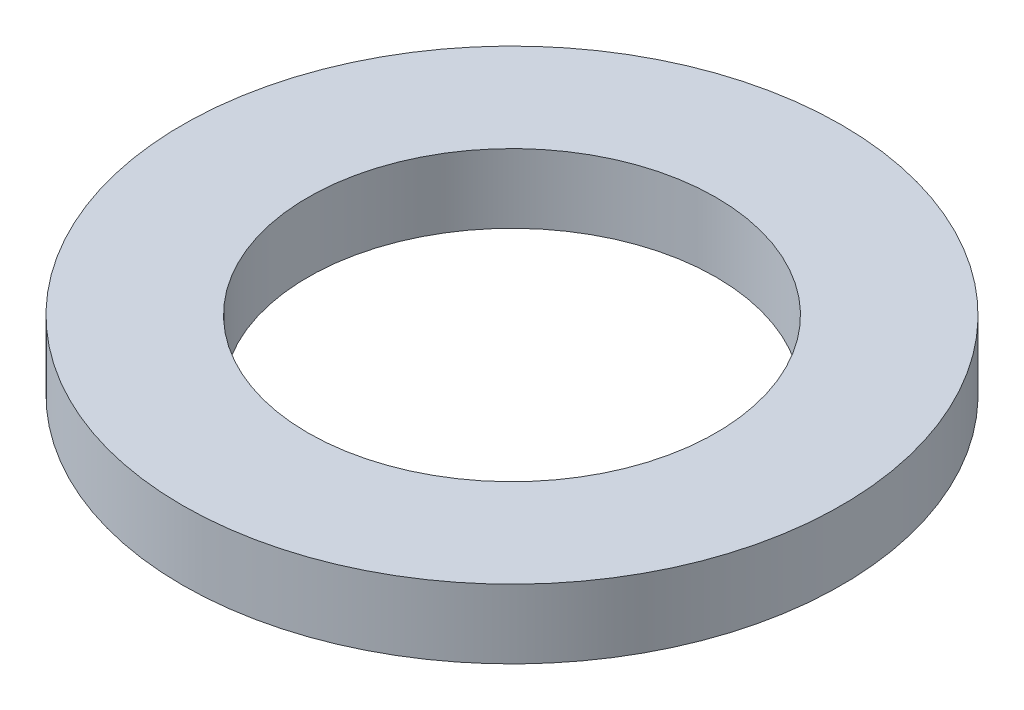
ISO-10303-21;
HEADER;
FILE_DESCRIPTION(('STEP AP214'),'2;1');
FILE_NAME('part.step','',(''),(''),'','','');
FILE_SCHEMA(('AUTOMOTIVE_DESIGN { 1 0 10303 214 1 1 1 1 }'));
ENDSEC;
DATA;
#1=APPLICATION_CONTEXT('core data for automotive mechanical design processes');
#2=APPLICATION_PROTOCOL_DEFINITION('international standard','automotive_design',2000,#1);
#3=PRODUCT_CONTEXT('',#1,'mechanical');
#4=PRODUCT('Part','Part','',(#3));
#5=PRODUCT_RELATED_PRODUCT_CATEGORY('part','',(#4));
#6=PRODUCT_DEFINITION_FORMATION('','',#4);
#7=PRODUCT_DEFINITION_CONTEXT('part definition',#1,'design');
#8=PRODUCT_DEFINITION('design','',#6,#7);
#9=PRODUCT_DEFINITION_SHAPE('','',#8);
#10=(LENGTH_UNIT() NAMED_UNIT(*) SI_UNIT(.MILLI.,.METRE.));
#11=(NAMED_UNIT(*) PLANE_ANGLE_UNIT() SI_UNIT($,.RADIAN.));
#12=(NAMED_UNIT(*) SI_UNIT($,.STERADIAN.) SOLID_ANGLE_UNIT());
#13=UNCERTAINTY_MEASURE_WITH_UNIT(LENGTH_MEASURE(1.E-05),#10,'distance_accuracy_value','');
#14=(GEOMETRIC_REPRESENTATION_CONTEXT(3) GLOBAL_UNCERTAINTY_ASSIGNED_CONTEXT((#13)) GLOBAL_UNIT_ASSIGNED_CONTEXT((#10,
#11,#12)) REPRESENTATION_CONTEXT('',''));
#15=CARTESIAN_POINT('',(0.,0.,0.));
#16=DIRECTION('',(0.,0.,1.));
#17=DIRECTION('',(1.,0.,0.));
#18=AXIS2_PLACEMENT_3D('',#15,#16,#17);
#19=CARTESIAN_POINT('',(0.,11.,0.));
#20=DIRECTION('',(0.,-1.,0.));
#21=DIRECTION('',(0.,0.,-1.));
#22=AXIS2_PLACEMENT_3D('',#19,#20,#21);
#23=CYLINDRICAL_SURFACE('',#22,52.5);
#24=CARTESIAN_POINT('',(0.,11.,0.));
#25=DIRECTION('',(0.,1.,0.));
#26=DIRECTION('',(0.,0.,1.));
#27=AXIS2_PLACEMENT_3D('',#24,#25,#26);
#28=CIRCLE('',#27,52.5);
#29=CARTESIAN_POINT('',(0.,11.,52.5));
#30=VERTEX_POINT('',#29);
#31=EDGE_CURVE('E10',#30,#30,#28,.T.);
#32=ORIENTED_EDGE('',*,*,#31,.F.);
#33=EDGE_LOOP('',(#32));
#34=FACE_BOUND('',#33,.T.);
#35=CARTESIAN_POINT('',(0.,0.,0.));
#36=DIRECTION('',(0.,1.,0.));
#37=DIRECTION('',(0.,0.,1.));
#38=AXIS2_PLACEMENT_3D('',#35,#36,#37);
#39=CIRCLE('',#38,52.5);
#40=CARTESIAN_POINT('',(0.,0.,52.5));
#41=VERTEX_POINT('',#40);
#42=EDGE_CURVE('E37',#41,#41,#39,.T.);
#43=ORIENTED_EDGE('',*,*,#42,.T.);
#44=EDGE_LOOP('',(#43));
#45=FACE_BOUND('',#44,.T.);
#46=ADVANCED_FACE('F40',(#34,#45),#23,.T.);
#47=CARTESIAN_POINT('',(0.,11.,0.));
#48=DIRECTION('',(0.,1.,0.));
#49=DIRECTION('',(0.,0.,1.));
#50=AXIS2_PLACEMENT_3D('',#47,#48,#49);
#51=PLANE('',#50);
#52=CARTESIAN_POINT('',(0.,11.,0.));
#53=DIRECTION('',(0.,1.,0.));
#54=DIRECTION('',(0.,0.,1.));
#55=AXIS2_PLACEMENT_3D('',#52,#53,#54);
#56=CIRCLE('',#55,32.5);
#57=CARTESIAN_POINT('',(0.,11.,32.5));
#58=VERTEX_POINT('',#57);
#59=EDGE_CURVE('E50',#58,#58,#56,.T.);
#60=ORIENTED_EDGE('',*,*,#59,.F.);
#61=EDGE_LOOP('',(#60));
#62=FACE_BOUND('',#61,.T.);
#63=ORIENTED_EDGE('',*,*,#31,.T.);
#64=EDGE_LOOP('',(#63));
#65=FACE_BOUND('',#64,.T.);
#66=ADVANCED_FACE('F59',(#62,#65),#51,.T.);
#67=CARTESIAN_POINT('',(0.,0.,0.));
#68=DIRECTION('',(0.,1.,0.));
#69=DIRECTION('',(0.,0.,1.));
#70=AXIS2_PLACEMENT_3D('',#67,#68,#69);
#71=PLANE('',#70);
#72=CARTESIAN_POINT('',(0.,0.,0.));
#73=DIRECTION('',(0.,1.,0.));
#74=DIRECTION('',(0.,0.,1.));
#75=AXIS2_PLACEMENT_3D('',#72,#73,#74);
#76=CIRCLE('',#75,32.5);
#77=CARTESIAN_POINT('',(0.,0.,32.5));
#78=VERTEX_POINT('',#77);
#79=EDGE_CURVE('E47',#78,#78,#76,.T.);
#80=ORIENTED_EDGE('',*,*,#79,.T.);
#81=EDGE_LOOP('',(#80));
#82=FACE_BOUND('',#81,.T.);
#83=ORIENTED_EDGE('',*,*,#42,.F.);
#84=EDGE_LOOP('',(#83));
#85=FACE_BOUND('',#84,.T.);
#86=ADVANCED_FACE('F58',(#82,#85),#71,.F.);
#87=CARTESIAN_POINT('',(0.,11.,0.));
#88=DIRECTION('',(0.,-1.,0.));
#89=DIRECTION('',(0.,0.,-1.));
#90=AXIS2_PLACEMENT_3D('',#87,#88,#89);
#91=CYLINDRICAL_SURFACE('',#90,32.5);
#92=ORIENTED_EDGE('',*,*,#59,.T.);
#93=EDGE_LOOP('',(#92));
#94=FACE_BOUND('',#93,.T.);
#95=ORIENTED_EDGE('',*,*,#79,.F.);
#96=EDGE_LOOP('',(#95));
#97=FACE_BOUND('',#96,.T.);
#98=ADVANCED_FACE('F54',(#94,#97),#91,.F.);
#99=CLOSED_SHELL('',(#46,#66,#86,#98));
#100=MANIFOLD_SOLID_BREP('B2',#99);
#101=ADVANCED_BREP_SHAPE_REPRESENTATION('',(#18,#100),#14);
#102=SHAPE_DEFINITION_REPRESENTATION(#9,#101);
ENDSEC;
END-ISO-10303-21;
